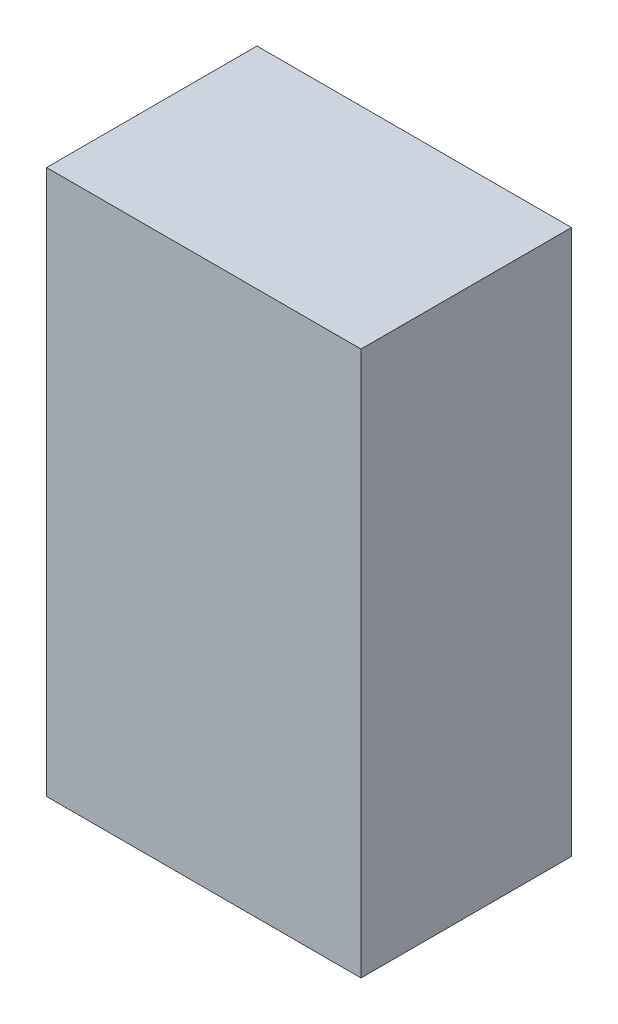
ISO-10303-21;
HEADER;
FILE_DESCRIPTION(('STEP AP214'),'2;1');
FILE_NAME('part.step','',(''),(''),'','','');
FILE_SCHEMA(('AUTOMOTIVE_DESIGN { 1 0 10303 214 1 1 1 1 }'));
ENDSEC;
DATA;
#1=APPLICATION_CONTEXT('core data for automotive mechanical design processes');
#2=APPLICATION_PROTOCOL_DEFINITION('international standard','automotive_design',2000,#1);
#3=PRODUCT_CONTEXT('',#1,'mechanical');
#4=PRODUCT('Part','Part','',(#3));
#5=PRODUCT_RELATED_PRODUCT_CATEGORY('part','',(#4));
#6=PRODUCT_DEFINITION_FORMATION('','',#4);
#7=PRODUCT_DEFINITION_CONTEXT('part definition',#1,'design');
#8=PRODUCT_DEFINITION('design','',#6,#7);
#9=PRODUCT_DEFINITION_SHAPE('','',#8);
#10=(LENGTH_UNIT() NAMED_UNIT(*) SI_UNIT(.MILLI.,.METRE.));
#11=(NAMED_UNIT(*) PLANE_ANGLE_UNIT() SI_UNIT($,.RADIAN.));
#12=(NAMED_UNIT(*) SI_UNIT($,.STERADIAN.) SOLID_ANGLE_UNIT());
#13=UNCERTAINTY_MEASURE_WITH_UNIT(LENGTH_MEASURE(1.E-05),#10,'distance_accuracy_value','');
#14=(GEOMETRIC_REPRESENTATION_CONTEXT(3) GLOBAL_UNCERTAINTY_ASSIGNED_CONTEXT((#13)) GLOBAL_UNIT_ASSIGNED_CONTEXT((#10,
#11,#12)) REPRESENTATION_CONTEXT('',''));
#15=CARTESIAN_POINT('',(0.,0.,0.));
#16=DIRECTION('',(0.,0.,1.));
#17=DIRECTION('',(1.,0.,0.));
#18=AXIS2_PLACEMENT_3D('',#15,#16,#17);
#19=CARTESIAN_POINT('',(0.635,-1.10000034,0.85000084));
#20=DIRECTION('',(0.,0.,1.));
#21=DIRECTION('',(1.,0.,0.));
#22=AXIS2_PLACEMENT_3D('',#19,#20,#21);
#23=PLANE('',#22);
#24=DIRECTION('',(0.,1.,0.));
#25=VECTOR('',#24,1.);
#26=CARTESIAN_POINT('',(-0.635,-1.10000034,0.85000084));
#27=LINE('',#26,#25);
#28=CARTESIAN_POINT('',(-0.635,-1.10000034,0.85000084));
#29=VERTEX_POINT('',#28);
#30=CARTESIAN_POINT('',(-0.635,1.10000034,0.85000084));
#31=VERTEX_POINT('',#30);
#32=EDGE_CURVE('E53',#29,#31,#27,.T.);
#33=ORIENTED_EDGE('',*,*,#32,.F.);
#34=DIRECTION('',(1.,0.,0.));
#35=VECTOR('',#34,1.);
#36=CARTESIAN_POINT('',(0.635,-1.10000034,0.85000084));
#37=LINE('',#36,#35);
#38=CARTESIAN_POINT('',(0.635,-1.10000034,0.85000084));
#39=VERTEX_POINT('',#38);
#40=EDGE_CURVE('E20',#29,#39,#37,.T.);
#41=ORIENTED_EDGE('',*,*,#40,.T.);
#42=DIRECTION('',(0.,1.,0.));
#43=VECTOR('',#42,1.);
#44=CARTESIAN_POINT('',(0.635,1.10000034,0.85000084));
#45=LINE('',#44,#43);
#46=CARTESIAN_POINT('',(0.635,1.10000034,0.85000084));
#47=VERTEX_POINT('',#46);
#48=EDGE_CURVE('E67',#47,#39,#45,.F.);
#49=ORIENTED_EDGE('',*,*,#48,.F.);
#50=DIRECTION('',(1.,0.,0.));
#51=VECTOR('',#50,1.);
#52=CARTESIAN_POINT('',(-0.635,1.10000034,0.85000084));
#53=LINE('',#52,#51);
#54=EDGE_CURVE('E58',#31,#47,#53,.T.);
#55=ORIENTED_EDGE('',*,*,#54,.F.);
#56=EDGE_LOOP('',(#33,#41,#49,#55));
#57=FACE_BOUND('',#56,.T.);
#58=ADVANCED_FACE('F17',(#57),#23,.T.);
#59=CARTESIAN_POINT('',(0.635,1.10000034,0.));
#60=DIRECTION('',(1.,0.,0.));
#61=DIRECTION('',(0.,0.,-1.));
#62=AXIS2_PLACEMENT_3D('',#59,#60,#61);
#63=PLANE('',#62);
#64=DIRECTION('',(0.,0.,-1.));
#65=VECTOR('',#64,1.);
#66=CARTESIAN_POINT('',(0.635,-1.10000034,0.));
#67=LINE('',#66,#65);
#68=CARTESIAN_POINT('',(0.635,-1.10000034,0.));
#69=VERTEX_POINT('',#68);
#70=EDGE_CURVE('E80',#69,#39,#67,.F.);
#71=ORIENTED_EDGE('',*,*,#70,.F.);
#72=DIRECTION('',(0.,1.,0.));
#73=VECTOR('',#72,1.);
#74=CARTESIAN_POINT('',(0.635,-1.10000034,0.));
#75=LINE('',#74,#73);
#76=CARTESIAN_POINT('',(0.635,1.10000034,0.));
#77=VERTEX_POINT('',#76);
#78=EDGE_CURVE('E75',#69,#77,#75,.T.);
#79=ORIENTED_EDGE('',*,*,#78,.T.);
#80=DIRECTION('',(0.,0.,1.));
#81=VECTOR('',#80,1.);
#82=CARTESIAN_POINT('',(0.635,1.10000034,0.));
#83=LINE('',#82,#81);
#84=EDGE_CURVE('E63',#47,#77,#83,.F.);
#85=ORIENTED_EDGE('',*,*,#84,.F.);
#86=ORIENTED_EDGE('',*,*,#48,.T.);
#87=EDGE_LOOP('',(#71,#79,#85,#86));
#88=FACE_BOUND('',#87,.T.);
#89=ADVANCED_FACE('F74',(#88),#63,.T.);
#90=CARTESIAN_POINT('',(-0.635,1.10000034,0.));
#91=DIRECTION('',(0.,1.,0.));
#92=DIRECTION('',(0.,0.,1.));
#93=AXIS2_PLACEMENT_3D('',#90,#91,#92);
#94=PLANE('',#93);
#95=ORIENTED_EDGE('',*,*,#84,.T.);
#96=DIRECTION('',(1.,0.,0.));
#97=VECTOR('',#96,1.);
#98=CARTESIAN_POINT('',(0.635,1.10000034,0.));
#99=LINE('',#98,#97);
#100=CARTESIAN_POINT('',(-0.635,1.10000034,0.));
#101=VERTEX_POINT('',#100);
#102=EDGE_CURVE('E84',#77,#101,#99,.F.);
#103=ORIENTED_EDGE('',*,*,#102,.T.);
#104=DIRECTION('',(0.,0.,1.));
#105=VECTOR('',#104,1.);
#106=CARTESIAN_POINT('',(-0.635,1.10000034,0.));
#107=LINE('',#106,#105);
#108=EDGE_CURVE('E65',#31,#101,#107,.F.);
#109=ORIENTED_EDGE('',*,*,#108,.F.);
#110=ORIENTED_EDGE('',*,*,#54,.T.);
#111=EDGE_LOOP('',(#95,#103,#109,#110));
#112=FACE_BOUND('',#111,.T.);
#113=ADVANCED_FACE('F60',(#112),#94,.T.);
#114=CARTESIAN_POINT('',(-0.635,-1.10000034,0.));
#115=DIRECTION('',(-1.,0.,0.));
#116=DIRECTION('',(0.,0.,1.));
#117=AXIS2_PLACEMENT_3D('',#114,#115,#116);
#118=PLANE('',#117);
#119=ORIENTED_EDGE('',*,*,#108,.T.);
#120=DIRECTION('',(0.,1.,0.));
#121=VECTOR('',#120,1.);
#122=CARTESIAN_POINT('',(-0.635,-1.10000034,0.));
#123=LINE('',#122,#121);
#124=CARTESIAN_POINT('',(-0.635,-1.10000034,0.));
#125=VERTEX_POINT('',#124);
#126=EDGE_CURVE('E26',#101,#125,#123,.F.);
#127=ORIENTED_EDGE('',*,*,#126,.T.);
#128=DIRECTION('',(0.,0.,-1.));
#129=VECTOR('',#128,1.);
#130=CARTESIAN_POINT('',(-0.635,-1.10000034,0.));
#131=LINE('',#130,#129);
#132=EDGE_CURVE('E34',#29,#125,#131,.T.);
#133=ORIENTED_EDGE('',*,*,#132,.F.);
#134=ORIENTED_EDGE('',*,*,#32,.T.);
#135=EDGE_LOOP('',(#119,#127,#133,#134));
#136=FACE_BOUND('',#135,.T.);
#137=ADVANCED_FACE('F88',(#136),#118,.T.);
#138=CARTESIAN_POINT('',(0.635,-1.10000034,0.));
#139=DIRECTION('',(0.,-1.,0.));
#140=DIRECTION('',(0.,0.,-1.));
#141=AXIS2_PLACEMENT_3D('',#138,#139,#140);
#142=PLANE('',#141);
#143=ORIENTED_EDGE('',*,*,#132,.T.);
#144=DIRECTION('',(1.,0.,0.));
#145=VECTOR('',#144,1.);
#146=CARTESIAN_POINT('',(0.635,-1.10000034,0.));
#147=LINE('',#146,#145);
#148=EDGE_CURVE('E11',#125,#69,#147,.T.);
#149=ORIENTED_EDGE('',*,*,#148,.T.);
#150=ORIENTED_EDGE('',*,*,#70,.T.);
#151=ORIENTED_EDGE('',*,*,#40,.F.);
#152=EDGE_LOOP('',(#143,#149,#150,#151));
#153=FACE_BOUND('',#152,.T.);
#154=ADVANCED_FACE('F91',(#153),#142,.T.);
#155=CARTESIAN_POINT('',(0.635,-1.10000034,0.));
#156=DIRECTION('',(0.,0.,1.));
#157=DIRECTION('',(1.,0.,0.));
#158=AXIS2_PLACEMENT_3D('',#155,#156,#157);
#159=PLANE('',#158);
#160=ORIENTED_EDGE('',*,*,#126,.F.);
#161=ORIENTED_EDGE('',*,*,#102,.F.);
#162=ORIENTED_EDGE('',*,*,#78,.F.);
#163=ORIENTED_EDGE('',*,*,#148,.F.);
#164=EDGE_LOOP('',(#160,#161,#162,#163));
#165=FACE_BOUND('',#164,.T.);
#166=ADVANCED_FACE('F90',(#165),#159,.F.);
#167=CLOSED_SHELL('',(#58,#89,#113,#137,#154,#166));
#168=MANIFOLD_SOLID_BREP('B1',#167);
#169=ADVANCED_BREP_SHAPE_REPRESENTATION('',(#18,#168),#14);
#170=SHAPE_DEFINITION_REPRESENTATION(#9,#169);
ENDSEC;
END-ISO-10303-21;
